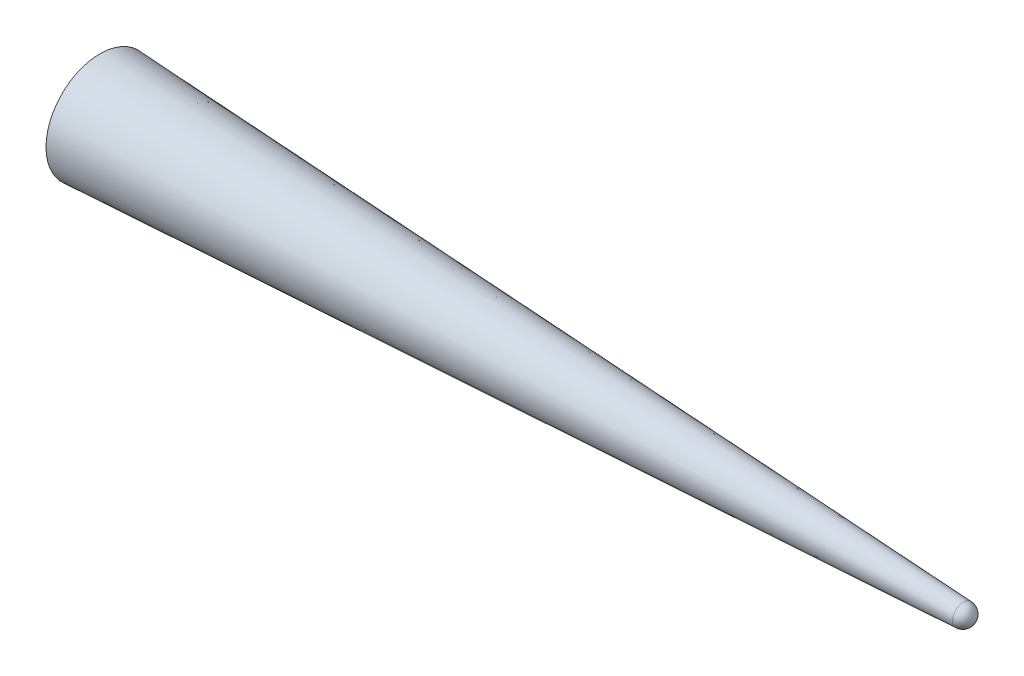
ISO-10303-21;
HEADER;
FILE_DESCRIPTION(('STEP AP214'),'2;1');
FILE_NAME('part.step','',(''),(''),'','','');
FILE_SCHEMA(('AUTOMOTIVE_DESIGN { 1 0 10303 214 1 1 1 1 }'));
ENDSEC;
DATA;
#1=APPLICATION_CONTEXT('core data for automotive mechanical design processes');
#2=APPLICATION_PROTOCOL_DEFINITION('international standard','automotive_design',2000,#1);
#3=PRODUCT_CONTEXT('',#1,'mechanical');
#4=PRODUCT('Part','Part','',(#3));
#5=PRODUCT_RELATED_PRODUCT_CATEGORY('part','',(#4));
#6=PRODUCT_DEFINITION_FORMATION('','',#4);
#7=PRODUCT_DEFINITION_CONTEXT('part definition',#1,'design');
#8=PRODUCT_DEFINITION('design','',#6,#7);
#9=PRODUCT_DEFINITION_SHAPE('','',#8);
#10=(LENGTH_UNIT() NAMED_UNIT(*) SI_UNIT(.MILLI.,.METRE.));
#11=(NAMED_UNIT(*) PLANE_ANGLE_UNIT() SI_UNIT($,.RADIAN.));
#12=(NAMED_UNIT(*) SI_UNIT($,.STERADIAN.) SOLID_ANGLE_UNIT());
#13=UNCERTAINTY_MEASURE_WITH_UNIT(LENGTH_MEASURE(1.E-05),#10,'distance_accuracy_value','');
#14=(GEOMETRIC_REPRESENTATION_CONTEXT(3) GLOBAL_UNCERTAINTY_ASSIGNED_CONTEXT((#13)) GLOBAL_UNIT_ASSIGNED_CONTEXT((#10,
#11,#12)) REPRESENTATION_CONTEXT('',''));
#15=CARTESIAN_POINT('',(0.,0.,0.));
#16=DIRECTION('',(0.,0.,1.));
#17=DIRECTION('',(1.,0.,0.));
#18=AXIS2_PLACEMENT_3D('',#15,#16,#17);
#19=CARTESIAN_POINT('',(799.750156054993,0.,0.));
#20=DIRECTION('',(-1.,0.,0.));
#21=DIRECTION('',(0.,0.,1.));
#22=AXIS2_PLACEMENT_3D('',#19,#20,#21);
#23=SPHERICAL_SURFACE('',#22,9.99999999999999);
#24=CARTESIAN_POINT('',(800.249532224431,0.,0.));
#25=DIRECTION('',(-1.,0.,0.));
#26=DIRECTION('',(0.,0.,1.));
#27=AXIS2_PLACEMENT_3D('',#24,#25,#26);
#28=CIRCLE('',#27,9.98752338877844);
#29=CARTESIAN_POINT('',(800.249532224431,0.,9.98752338877844));
#30=VERTEX_POINT('',#29);
#31=EDGE_CURVE('E10',#30,#30,#28,.T.);
#32=ORIENTED_EDGE('',*,*,#31,.F.);
#33=EDGE_LOOP('',(#32));
#34=FACE_BOUND('',#33,.T.);
#35=ADVANCED_FACE('F43',(#34),#23,.T.);
#36=CARTESIAN_POINT('',(800.249532224431,0.,0.));
#37=DIRECTION('',(-1.,0.,0.));
#38=DIRECTION('',(0.,0.,1.));
#39=AXIS2_PLACEMENT_3D('',#36,#37,#38);
#40=CONICAL_SURFACE('',#39,9.98752338877844,0.0499583957219428);
#41=CARTESIAN_POINT('',(0.,0.,0.));
#42=DIRECTION('',(-1.,0.,0.));
#43=DIRECTION('',(0.,0.,1.));
#44=AXIS2_PLACEMENT_3D('',#41,#42,#43);
#45=CIRCLE('',#44,50.);
#46=CARTESIAN_POINT('',(0.,0.,50.));
#47=VERTEX_POINT('',#46);
#48=EDGE_CURVE('E50',#47,#47,#45,.T.);
#49=ORIENTED_EDGE('',*,*,#48,.F.);
#50=EDGE_LOOP('',(#49));
#51=FACE_BOUND('',#50,.T.);
#52=ORIENTED_EDGE('',*,*,#31,.T.);
#53=EDGE_LOOP('',(#52));
#54=FACE_BOUND('',#53,.T.);
#55=ADVANCED_FACE('F59',(#51,#54),#40,.T.);
#56=CARTESIAN_POINT('',(0.,0.,0.));
#57=DIRECTION('',(1.,0.,0.));
#58=DIRECTION('',(0.,0.,-1.));
#59=AXIS2_PLACEMENT_3D('',#56,#57,#58);
#60=PLANE('',#59);
#61=ORIENTED_EDGE('',*,*,#48,.T.);
#62=EDGE_LOOP('',(#61));
#63=FACE_BOUND('',#62,.T.);
#64=ADVANCED_FACE('F57',(#63),#60,.F.);
#65=CLOSED_SHELL('',(#35,#55,#64));
#66=MANIFOLD_SOLID_BREP('B2',#65);
#67=ADVANCED_BREP_SHAPE_REPRESENTATION('',(#18,#66),#14);
#68=SHAPE_DEFINITION_REPRESENTATION(#9,#67);
ENDSEC;
END-ISO-10303-21;
